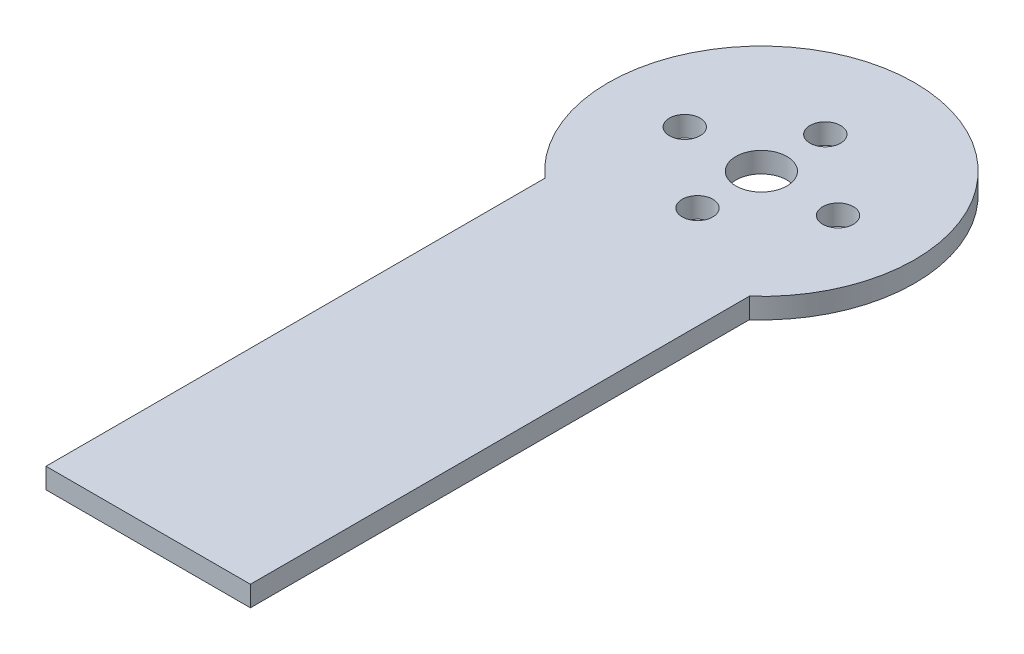
ISO-10303-21;
HEADER;
FILE_DESCRIPTION(('STEP AP214'),'2;1');
FILE_NAME('part.step','',(''),(''),'','','');
FILE_SCHEMA(('AUTOMOTIVE_DESIGN { 1 0 10303 214 1 1 1 1 }'));
ENDSEC;
DATA;
#1=APPLICATION_CONTEXT('core data for automotive mechanical design processes');
#2=APPLICATION_PROTOCOL_DEFINITION('international standard','automotive_design',2000,#1);
#3=PRODUCT_CONTEXT('',#1,'mechanical');
#4=PRODUCT('Part','Part','',(#3));
#5=PRODUCT_RELATED_PRODUCT_CATEGORY('part','',(#4));
#6=PRODUCT_DEFINITION_FORMATION('','',#4);
#7=PRODUCT_DEFINITION_CONTEXT('part definition',#1,'design');
#8=PRODUCT_DEFINITION('design','',#6,#7);
#9=PRODUCT_DEFINITION_SHAPE('','',#8);
#10=(LENGTH_UNIT() NAMED_UNIT(*) SI_UNIT(.MILLI.,.METRE.));
#11=(NAMED_UNIT(*) PLANE_ANGLE_UNIT() SI_UNIT($,.RADIAN.));
#12=(NAMED_UNIT(*) SI_UNIT($,.STERADIAN.) SOLID_ANGLE_UNIT());
#13=UNCERTAINTY_MEASURE_WITH_UNIT(LENGTH_MEASURE(1.E-05),#10,'distance_accuracy_value','');
#14=(GEOMETRIC_REPRESENTATION_CONTEXT(3) GLOBAL_UNCERTAINTY_ASSIGNED_CONTEXT((#13)) GLOBAL_UNIT_ASSIGNED_CONTEXT((#10,
#11,#12)) REPRESENTATION_CONTEXT('',''));
#15=CARTESIAN_POINT('',(0.,0.,0.));
#16=DIRECTION('',(0.,0.,1.));
#17=DIRECTION('',(1.,0.,0.));
#18=AXIS2_PLACEMENT_3D('',#15,#16,#17);
#19=CARTESIAN_POINT('',(12.7,2.54,0.));
#20=DIRECTION('',(-1.,0.,0.));
#21=DIRECTION('',(0.,0.,1.));
#22=AXIS2_PLACEMENT_3D('',#19,#20,#21);
#23=PLANE('',#22);
#24=DIRECTION('',(0.,0.,-1.));
#25=VECTOR('',#24,1.);
#26=CARTESIAN_POINT('',(12.7,0.,0.));
#27=LINE('',#26,#25);
#28=CARTESIAN_POINT('',(12.7,0.,76.2));
#29=VERTEX_POINT('',#28);
#30=CARTESIAN_POINT('',(12.7,0.,14.1990316571237));
#31=VERTEX_POINT('',#30);
#32=EDGE_CURVE('E114',#29,#31,#27,.T.);
#33=ORIENTED_EDGE('',*,*,#32,.T.);
#34=DIRECTION('',(0.,-1.,0.));
#35=VECTOR('',#34,1.);
#36=CARTESIAN_POINT('',(12.7,2.54,14.1990316571237));
#37=LINE('',#36,#35);
#38=CARTESIAN_POINT('',(12.7,2.54,14.1990316571237));
#39=VERTEX_POINT('',#38);
#40=EDGE_CURVE('E11',#39,#31,#37,.T.);
#41=ORIENTED_EDGE('',*,*,#40,.F.);
#42=DIRECTION('',(0.,0.,-1.));
#43=VECTOR('',#42,1.);
#44=CARTESIAN_POINT('',(12.7,2.54,0.));
#45=LINE('',#44,#43);
#46=CARTESIAN_POINT('',(12.7,2.54,76.2));
#47=VERTEX_POINT('',#46);
#48=EDGE_CURVE('E87',#47,#39,#45,.T.);
#49=ORIENTED_EDGE('',*,*,#48,.F.);
#50=DIRECTION('',(0.,-1.,0.));
#51=VECTOR('',#50,1.);
#52=CARTESIAN_POINT('',(12.7,2.54,76.2));
#53=LINE('',#52,#51);
#54=EDGE_CURVE('E113',#47,#29,#53,.T.);
#55=ORIENTED_EDGE('',*,*,#54,.T.);
#56=EDGE_LOOP('',(#33,#41,#49,#55));
#57=FACE_BOUND('',#56,.T.);
#58=ADVANCED_FACE('F35',(#57),#23,.F.);
#59=CARTESIAN_POINT('',(0.,2.54,0.));
#60=DIRECTION('',(0.,-1.,0.));
#61=DIRECTION('',(0.,0.,-1.));
#62=AXIS2_PLACEMENT_3D('',#59,#60,#61);
#63=CYLINDRICAL_SURFACE('',#62,19.05);
#64=CARTESIAN_POINT('',(0.,0.,0.));
#65=DIRECTION('',(0.,1.,0.));
#66=DIRECTION('',(0.,0.,1.));
#67=AXIS2_PLACEMENT_3D('',#64,#65,#66);
#68=CIRCLE('',#67,19.05);
#69=CARTESIAN_POINT('',(-12.7,0.,14.1990316571237));
#70=VERTEX_POINT('',#69);
#71=EDGE_CURVE('E91',#31,#70,#68,.T.);
#72=ORIENTED_EDGE('',*,*,#71,.T.);
#73=DIRECTION('',(0.,-1.,0.));
#74=VECTOR('',#73,1.);
#75=CARTESIAN_POINT('',(-12.7,2.54,14.1990316571237));
#76=LINE('',#75,#74);
#77=CARTESIAN_POINT('',(-12.7,2.54,14.1990316571237));
#78=VERTEX_POINT('',#77);
#79=EDGE_CURVE('E43',#78,#70,#76,.T.);
#80=ORIENTED_EDGE('',*,*,#79,.F.);
#81=CARTESIAN_POINT('',(0.,2.54,0.));
#82=DIRECTION('',(0.,1.,0.));
#83=DIRECTION('',(0.,0.,1.));
#84=AXIS2_PLACEMENT_3D('',#81,#82,#83);
#85=CIRCLE('',#84,19.05);
#86=EDGE_CURVE('E81',#39,#78,#85,.T.);
#87=ORIENTED_EDGE('',*,*,#86,.F.);
#88=ORIENTED_EDGE('',*,*,#40,.T.);
#89=EDGE_LOOP('',(#72,#80,#87,#88));
#90=FACE_BOUND('',#89,.T.);
#91=ADVANCED_FACE('F90',(#90),#63,.T.);
#92=CARTESIAN_POINT('',(-12.7,2.54,0.));
#93=DIRECTION('',(1.,0.,0.));
#94=DIRECTION('',(0.,0.,-1.));
#95=AXIS2_PLACEMENT_3D('',#92,#93,#94);
#96=PLANE('',#95);
#97=DIRECTION('',(0.,0.,1.));
#98=VECTOR('',#97,1.);
#99=CARTESIAN_POINT('',(-12.7,0.,0.));
#100=LINE('',#99,#98);
#101=CARTESIAN_POINT('',(-12.7,0.,76.2));
#102=VERTEX_POINT('',#101);
#103=EDGE_CURVE('E68',#70,#102,#100,.T.);
#104=ORIENTED_EDGE('',*,*,#103,.T.);
#105=DIRECTION('',(0.,-1.,0.));
#106=VECTOR('',#105,1.);
#107=CARTESIAN_POINT('',(-12.7,2.54,76.2));
#108=LINE('',#107,#106);
#109=CARTESIAN_POINT('',(-12.7,2.54,76.2));
#110=VERTEX_POINT('',#109);
#111=EDGE_CURVE('E92',#110,#102,#108,.T.);
#112=ORIENTED_EDGE('',*,*,#111,.F.);
#113=DIRECTION('',(0.,0.,1.));
#114=VECTOR('',#113,1.);
#115=CARTESIAN_POINT('',(-12.7,2.54,0.));
#116=LINE('',#115,#114);
#117=EDGE_CURVE('E85',#78,#110,#116,.T.);
#118=ORIENTED_EDGE('',*,*,#117,.F.);
#119=ORIENTED_EDGE('',*,*,#79,.T.);
#120=EDGE_LOOP('',(#104,#112,#118,#119));
#121=FACE_BOUND('',#120,.T.);
#122=ADVANCED_FACE('F93',(#121),#96,.F.);
#123=CARTESIAN_POINT('',(0.,2.54,-7.9375));
#124=DIRECTION('',(0.,-1.,0.));
#125=DIRECTION('',(0.,0.,-1.));
#126=AXIS2_PLACEMENT_3D('',#123,#124,#125);
#127=CYLINDRICAL_SURFACE('',#126,1.905);
#128=CARTESIAN_POINT('',(0.,2.54,-7.9375));
#129=DIRECTION('',(0.,1.,0.));
#130=DIRECTION('',(0.,0.,1.));
#131=AXIS2_PLACEMENT_3D('',#128,#129,#130);
#132=CIRCLE('',#131,1.905);
#133=CARTESIAN_POINT('',(0.,2.54,-6.0325));
#134=VERTEX_POINT('',#133);
#135=EDGE_CURVE('E107',#134,#134,#132,.T.);
#136=ORIENTED_EDGE('',*,*,#135,.T.);
#137=EDGE_LOOP('',(#136));
#138=FACE_BOUND('',#137,.T.);
#139=CARTESIAN_POINT('',(0.,0.,-7.9375));
#140=DIRECTION('',(0.,1.,0.));
#141=DIRECTION('',(0.,0.,1.));
#142=AXIS2_PLACEMENT_3D('',#139,#140,#141);
#143=CIRCLE('',#142,1.905);
#144=CARTESIAN_POINT('',(0.,0.,-6.0325));
#145=VERTEX_POINT('',#144);
#146=EDGE_CURVE('E129',#145,#145,#143,.T.);
#147=ORIENTED_EDGE('',*,*,#146,.F.);
#148=EDGE_LOOP('',(#147));
#149=FACE_BOUND('',#148,.T.);
#150=ADVANCED_FACE('F149',(#138,#149),#127,.F.);
#151=CARTESIAN_POINT('',(9.525,2.54,0.));
#152=DIRECTION('',(0.,-1.,0.));
#153=DIRECTION('',(0.,0.,-1.));
#154=AXIS2_PLACEMENT_3D('',#151,#152,#153);
#155=CYLINDRICAL_SURFACE('',#154,1.905);
#156=CARTESIAN_POINT('',(9.525,2.54,0.));
#157=DIRECTION('',(0.,1.,0.));
#158=DIRECTION('',(0.,0.,1.));
#159=AXIS2_PLACEMENT_3D('',#156,#157,#158);
#160=CIRCLE('',#159,1.905);
#161=CARTESIAN_POINT('',(9.525,2.54,1.905));
#162=VERTEX_POINT('',#161);
#163=EDGE_CURVE('E104',#162,#162,#160,.T.);
#164=ORIENTED_EDGE('',*,*,#163,.T.);
#165=EDGE_LOOP('',(#164));
#166=FACE_BOUND('',#165,.T.);
#167=CARTESIAN_POINT('',(9.525,0.,0.));
#168=DIRECTION('',(0.,1.,0.));
#169=DIRECTION('',(0.,0.,1.));
#170=AXIS2_PLACEMENT_3D('',#167,#168,#169);
#171=CIRCLE('',#170,1.905);
#172=CARTESIAN_POINT('',(9.525,0.,1.905));
#173=VERTEX_POINT('',#172);
#174=EDGE_CURVE('E126',#173,#173,#171,.T.);
#175=ORIENTED_EDGE('',*,*,#174,.F.);
#176=EDGE_LOOP('',(#175));
#177=FACE_BOUND('',#176,.T.);
#178=ADVANCED_FACE('F162',(#166,#177),#155,.F.);
#179=CARTESIAN_POINT('',(0.,2.54,7.9375));
#180=DIRECTION('',(0.,-1.,0.));
#181=DIRECTION('',(0.,0.,-1.));
#182=AXIS2_PLACEMENT_3D('',#179,#180,#181);
#183=CYLINDRICAL_SURFACE('',#182,1.905);
#184=CARTESIAN_POINT('',(0.,2.54,7.9375));
#185=DIRECTION('',(0.,1.,0.));
#186=DIRECTION('',(0.,0.,1.));
#187=AXIS2_PLACEMENT_3D('',#184,#185,#186);
#188=CIRCLE('',#187,1.905);
#189=CARTESIAN_POINT('',(0.,2.54,9.8425));
#190=VERTEX_POINT('',#189);
#191=EDGE_CURVE('E101',#190,#190,#188,.T.);
#192=ORIENTED_EDGE('',*,*,#191,.T.);
#193=EDGE_LOOP('',(#192));
#194=FACE_BOUND('',#193,.T.);
#195=CARTESIAN_POINT('',(0.,0.,7.9375));
#196=DIRECTION('',(0.,1.,0.));
#197=DIRECTION('',(0.,0.,1.));
#198=AXIS2_PLACEMENT_3D('',#195,#196,#197);
#199=CIRCLE('',#198,1.905);
#200=CARTESIAN_POINT('',(0.,0.,9.8425));
#201=VERTEX_POINT('',#200);
#202=EDGE_CURVE('E123',#201,#201,#199,.T.);
#203=ORIENTED_EDGE('',*,*,#202,.F.);
#204=EDGE_LOOP('',(#203));
#205=FACE_BOUND('',#204,.T.);
#206=ADVANCED_FACE('F158',(#194,#205),#183,.F.);
#207=CARTESIAN_POINT('',(0.,2.54,0.));
#208=DIRECTION('',(0.,-1.,0.));
#209=DIRECTION('',(0.,0.,-1.));
#210=AXIS2_PLACEMENT_3D('',#207,#208,#209);
#211=CYLINDRICAL_SURFACE('',#210,3.175);
#212=CARTESIAN_POINT('',(0.,2.54,0.));
#213=DIRECTION('',(0.,1.,0.));
#214=DIRECTION('',(0.,0.,1.));
#215=AXIS2_PLACEMENT_3D('',#212,#213,#214);
#216=CIRCLE('',#215,3.175);
#217=CARTESIAN_POINT('',(0.,2.54,3.175));
#218=VERTEX_POINT('',#217);
#219=EDGE_CURVE('E95',#218,#218,#216,.T.);
#220=ORIENTED_EDGE('',*,*,#219,.T.);
#221=EDGE_LOOP('',(#220));
#222=FACE_BOUND('',#221,.T.);
#223=CARTESIAN_POINT('',(0.,0.,0.));
#224=DIRECTION('',(0.,1.,0.));
#225=DIRECTION('',(0.,0.,1.));
#226=AXIS2_PLACEMENT_3D('',#223,#224,#225);
#227=CIRCLE('',#226,3.175);
#228=CARTESIAN_POINT('',(0.,0.,3.175));
#229=VERTEX_POINT('',#228);
#230=EDGE_CURVE('E120',#229,#229,#227,.T.);
#231=ORIENTED_EDGE('',*,*,#230,.F.);
#232=EDGE_LOOP('',(#231));
#233=FACE_BOUND('',#232,.T.);
#234=ADVANCED_FACE('F155',(#222,#233),#211,.F.);
#235=CARTESIAN_POINT('',(0.,2.54,76.2));
#236=DIRECTION('',(0.,0.,-1.));
#237=DIRECTION('',(-1.,0.,0.));
#238=AXIS2_PLACEMENT_3D('',#235,#236,#237);
#239=PLANE('',#238);
#240=DIRECTION('',(1.,0.,0.));
#241=VECTOR('',#240,1.);
#242=CARTESIAN_POINT('',(0.,0.,76.2));
#243=LINE('',#242,#241);
#244=EDGE_CURVE('E74',#102,#29,#243,.T.);
#245=ORIENTED_EDGE('',*,*,#244,.T.);
#246=ORIENTED_EDGE('',*,*,#54,.F.);
#247=DIRECTION('',(1.,0.,0.));
#248=VECTOR('',#247,1.);
#249=CARTESIAN_POINT('',(0.,2.54,76.2));
#250=LINE('',#249,#248);
#251=EDGE_CURVE('E51',#110,#47,#250,.T.);
#252=ORIENTED_EDGE('',*,*,#251,.F.);
#253=ORIENTED_EDGE('',*,*,#111,.T.);
#254=EDGE_LOOP('',(#245,#246,#252,#253));
#255=FACE_BOUND('',#254,.T.);
#256=ADVANCED_FACE('F136',(#255),#239,.F.);
#257=CARTESIAN_POINT('',(-9.525,2.54,0.));
#258=DIRECTION('',(0.,-1.,0.));
#259=DIRECTION('',(0.,0.,-1.));
#260=AXIS2_PLACEMENT_3D('',#257,#258,#259);
#261=CYLINDRICAL_SURFACE('',#260,1.905);
#262=CARTESIAN_POINT('',(-9.525,2.54,0.));
#263=DIRECTION('',(0.,1.,0.));
#264=DIRECTION('',(0.,0.,1.));
#265=AXIS2_PLACEMENT_3D('',#262,#263,#264);
#266=CIRCLE('',#265,1.905);
#267=CARTESIAN_POINT('',(-9.525,2.54,1.905));
#268=VERTEX_POINT('',#267);
#269=EDGE_CURVE('E110',#268,#268,#266,.T.);
#270=ORIENTED_EDGE('',*,*,#269,.T.);
#271=EDGE_LOOP('',(#270));
#272=FACE_BOUND('',#271,.T.);
#273=CARTESIAN_POINT('',(-9.525,0.,0.));
#274=DIRECTION('',(0.,1.,0.));
#275=DIRECTION('',(0.,0.,1.));
#276=AXIS2_PLACEMENT_3D('',#273,#274,#275);
#277=CIRCLE('',#276,1.905);
#278=CARTESIAN_POINT('',(-9.525,0.,1.905));
#279=VERTEX_POINT('',#278);
#280=EDGE_CURVE('E132',#279,#279,#277,.T.);
#281=ORIENTED_EDGE('',*,*,#280,.F.);
#282=EDGE_LOOP('',(#281));
#283=FACE_BOUND('',#282,.T.);
#284=ADVANCED_FACE('F154',(#272,#283),#261,.F.);
#285=CARTESIAN_POINT('',(0.,2.54,0.));
#286=DIRECTION('',(0.,1.,0.));
#287=DIRECTION('',(0.,0.,1.));
#288=AXIS2_PLACEMENT_3D('',#285,#286,#287);
#289=PLANE('',#288);
#290=ORIENTED_EDGE('',*,*,#48,.T.);
#291=ORIENTED_EDGE('',*,*,#86,.T.);
#292=ORIENTED_EDGE('',*,*,#117,.T.);
#293=ORIENTED_EDGE('',*,*,#251,.T.);
#294=EDGE_LOOP('',(#290,#291,#292,#293));
#295=FACE_BOUND('',#294,.T.);
#296=ORIENTED_EDGE('',*,*,#219,.F.);
#297=EDGE_LOOP('',(#296));
#298=FACE_BOUND('',#297,.T.);
#299=ORIENTED_EDGE('',*,*,#191,.F.);
#300=EDGE_LOOP('',(#299));
#301=FACE_BOUND('',#300,.T.);
#302=ORIENTED_EDGE('',*,*,#163,.F.);
#303=EDGE_LOOP('',(#302));
#304=FACE_BOUND('',#303,.T.);
#305=ORIENTED_EDGE('',*,*,#135,.F.);
#306=EDGE_LOOP('',(#305));
#307=FACE_BOUND('',#306,.T.);
#308=ORIENTED_EDGE('',*,*,#269,.F.);
#309=EDGE_LOOP('',(#308));
#310=FACE_BOUND('',#309,.T.);
#311=ADVANCED_FACE('F82',(#295,#298,#301,#304,#307,#310),#289,.T.);
#312=CARTESIAN_POINT('',(0.,0.,0.));
#313=DIRECTION('',(0.,1.,0.));
#314=DIRECTION('',(0.,0.,1.));
#315=AXIS2_PLACEMENT_3D('',#312,#313,#314);
#316=PLANE('',#315);
#317=ORIENTED_EDGE('',*,*,#32,.F.);
#318=ORIENTED_EDGE('',*,*,#244,.F.);
#319=ORIENTED_EDGE('',*,*,#103,.F.);
#320=ORIENTED_EDGE('',*,*,#71,.F.);
#321=EDGE_LOOP('',(#317,#318,#319,#320));
#322=FACE_BOUND('',#321,.T.);
#323=ORIENTED_EDGE('',*,*,#230,.T.);
#324=EDGE_LOOP('',(#323));
#325=FACE_BOUND('',#324,.T.);
#326=ORIENTED_EDGE('',*,*,#202,.T.);
#327=EDGE_LOOP('',(#326));
#328=FACE_BOUND('',#327,.T.);
#329=ORIENTED_EDGE('',*,*,#174,.T.);
#330=EDGE_LOOP('',(#329));
#331=FACE_BOUND('',#330,.T.);
#332=ORIENTED_EDGE('',*,*,#146,.T.);
#333=EDGE_LOOP('',(#332));
#334=FACE_BOUND('',#333,.T.);
#335=ORIENTED_EDGE('',*,*,#280,.T.);
#336=EDGE_LOOP('',(#335));
#337=FACE_BOUND('',#336,.T.);
#338=ADVANCED_FACE('F139',(#322,#325,#328,#331,#334,#337),#316,.F.);
#339=CLOSED_SHELL('',(#58,#91,#122,#150,#178,#206,#234,#256,#284,#311,#338));
#340=MANIFOLD_SOLID_BREP('B2',#339);
#341=ADVANCED_BREP_SHAPE_REPRESENTATION('',(#18,#340),#14);
#342=SHAPE_DEFINITION_REPRESENTATION(#9,#341);
ENDSEC;
END-ISO-10303-21;
